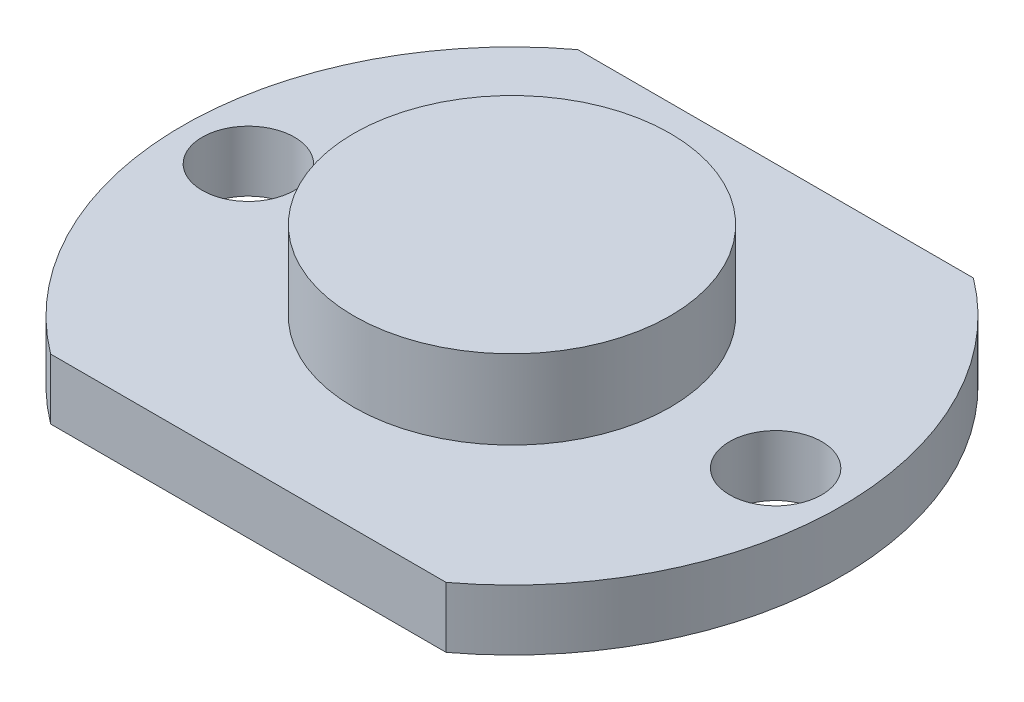
ISO-10303-21;
HEADER;
FILE_DESCRIPTION(('STEP AP214'),'2;1');
FILE_NAME('part.step','',(''),(''),'','','');
FILE_SCHEMA(('AUTOMOTIVE_DESIGN { 1 0 10303 214 1 1 1 1 }'));
ENDSEC;
DATA;
#1=APPLICATION_CONTEXT('core data for automotive mechanical design processes');
#2=APPLICATION_PROTOCOL_DEFINITION('international standard','automotive_design',2000,#1);
#3=PRODUCT_CONTEXT('',#1,'mechanical');
#4=PRODUCT('Part','Part','',(#3));
#5=PRODUCT_RELATED_PRODUCT_CATEGORY('part','',(#4));
#6=PRODUCT_DEFINITION_FORMATION('','',#4);
#7=PRODUCT_DEFINITION_CONTEXT('part definition',#1,'design');
#8=PRODUCT_DEFINITION('design','',#6,#7);
#9=PRODUCT_DEFINITION_SHAPE('','',#8);
#10=(LENGTH_UNIT() NAMED_UNIT(*) SI_UNIT(.MILLI.,.METRE.));
#11=(NAMED_UNIT(*) PLANE_ANGLE_UNIT() SI_UNIT($,.RADIAN.));
#12=(NAMED_UNIT(*) SI_UNIT($,.STERADIAN.) SOLID_ANGLE_UNIT());
#13=UNCERTAINTY_MEASURE_WITH_UNIT(LENGTH_MEASURE(1.E-05),#10,'distance_accuracy_value','');
#14=(GEOMETRIC_REPRESENTATION_CONTEXT(3) GLOBAL_UNCERTAINTY_ASSIGNED_CONTEXT((#13)) GLOBAL_UNIT_ASSIGNED_CONTEXT((#10,
#11,#12)) REPRESENTATION_CONTEXT('',''));
#15=CARTESIAN_POINT('',(0.,0.,0.));
#16=DIRECTION('',(0.,0.,1.));
#17=DIRECTION('',(1.,0.,0.));
#18=AXIS2_PLACEMENT_3D('',#15,#16,#17);
#19=CARTESIAN_POINT('',(0.,2.3,0.));
#20=DIRECTION('',(0.,1.,0.));
#21=DIRECTION('',(0.,0.,1.));
#22=AXIS2_PLACEMENT_3D('',#19,#20,#21);
#23=PLANE('',#22);
#24=CARTESIAN_POINT('',(-10.,2.3,0.));
#25=DIRECTION('',(0.,1.,0.));
#26=DIRECTION('',(0.,0.,1.));
#27=AXIS2_PLACEMENT_3D('',#24,#25,#26);
#28=CIRCLE('',#27,1.75);
#29=CARTESIAN_POINT('',(-10.,2.3,1.75));
#30=VERTEX_POINT('',#29);
#31=EDGE_CURVE('E115',#30,#30,#28,.T.);
#32=ORIENTED_EDGE('',*,*,#31,.F.);
#33=EDGE_LOOP('',(#32));
#34=FACE_BOUND('',#33,.T.);
#35=CARTESIAN_POINT('',(0.,2.3,0.));
#36=DIRECTION('',(0.,1.,0.));
#37=DIRECTION('',(0.,0.,1.));
#38=AXIS2_PLACEMENT_3D('',#35,#36,#37);
#39=CIRCLE('',#38,12.5);
#40=CARTESIAN_POINT('',(7.5,2.3,10.));
#41=VERTEX_POINT('',#40);
#42=CARTESIAN_POINT('',(7.5,2.3,-10.));
#43=VERTEX_POINT('',#42);
#44=EDGE_CURVE('E85',#41,#43,#39,.T.);
#45=ORIENTED_EDGE('',*,*,#44,.T.);
#46=DIRECTION('',(-1.,0.,0.));
#47=VECTOR('',#46,1.);
#48=CARTESIAN_POINT('',(7.5,2.3,-10.));
#49=LINE('',#48,#47);
#50=CARTESIAN_POINT('',(-7.5,2.3,-10.));
#51=VERTEX_POINT('',#50);
#52=EDGE_CURVE('E80',#43,#51,#49,.T.);
#53=ORIENTED_EDGE('',*,*,#52,.T.);
#54=CARTESIAN_POINT('',(0.,2.3,0.));
#55=DIRECTION('',(0.,1.,0.));
#56=DIRECTION('',(0.,0.,1.));
#57=AXIS2_PLACEMENT_3D('',#54,#55,#56);
#58=CIRCLE('',#57,12.5);
#59=CARTESIAN_POINT('',(-7.5,2.3,10.));
#60=VERTEX_POINT('',#59);
#61=EDGE_CURVE('E83',#51,#60,#58,.T.);
#62=ORIENTED_EDGE('',*,*,#61,.T.);
#63=DIRECTION('',(1.,0.,0.));
#64=VECTOR('',#63,1.);
#65=CARTESIAN_POINT('',(7.5,2.3,10.));
#66=LINE('',#65,#64);
#67=EDGE_CURVE('E50',#60,#41,#66,.T.);
#68=ORIENTED_EDGE('',*,*,#67,.T.);
#69=EDGE_LOOP('',(#45,#53,#62,#68));
#70=FACE_BOUND('',#69,.T.);
#71=CARTESIAN_POINT('',(10.,2.3,0.));
#72=DIRECTION('',(0.,1.,0.));
#73=DIRECTION('',(0.,0.,1.));
#74=AXIS2_PLACEMENT_3D('',#71,#72,#73);
#75=CIRCLE('',#74,1.75);
#76=CARTESIAN_POINT('',(10.,2.3,1.75));
#77=VERTEX_POINT('',#76);
#78=EDGE_CURVE('E100',#77,#77,#75,.T.);
#79=ORIENTED_EDGE('',*,*,#78,.F.);
#80=EDGE_LOOP('',(#79));
#81=FACE_BOUND('',#80,.T.);
#82=CARTESIAN_POINT('',(0.,2.3,0.));
#83=DIRECTION('',(0.,1.,0.));
#84=DIRECTION('',(0.,0.,1.));
#85=AXIS2_PLACEMENT_3D('',#82,#83,#84);
#86=CIRCLE('',#85,6.);
#87=CARTESIAN_POINT('',(0.,2.3,6.));
#88=VERTEX_POINT('',#87);
#89=EDGE_CURVE('E124',#88,#88,#86,.T.);
#90=ORIENTED_EDGE('',*,*,#89,.F.);
#91=EDGE_LOOP('',(#90));
#92=FACE_BOUND('',#91,.T.);
#93=ADVANCED_FACE('F33',(#34,#70,#81,#92),#23,.T.);
#94=CARTESIAN_POINT('',(0.,0.,0.));
#95=DIRECTION('',(0.,1.,0.));
#96=DIRECTION('',(0.,0.,1.));
#97=AXIS2_PLACEMENT_3D('',#94,#95,#96);
#98=PLANE('',#97);
#99=CARTESIAN_POINT('',(10.,0.,0.));
#100=DIRECTION('',(0.,1.,0.));
#101=DIRECTION('',(0.,0.,1.));
#102=AXIS2_PLACEMENT_3D('',#99,#100,#101);
#103=CIRCLE('',#102,1.75);
#104=CARTESIAN_POINT('',(10.,0.,1.75));
#105=VERTEX_POINT('',#104);
#106=EDGE_CURVE('E112',#105,#105,#103,.T.);
#107=ORIENTED_EDGE('',*,*,#106,.T.);
#108=EDGE_LOOP('',(#107));
#109=FACE_BOUND('',#108,.T.);
#110=CARTESIAN_POINT('',(0.,0.,0.));
#111=DIRECTION('',(0.,1.,0.));
#112=DIRECTION('',(0.,0.,1.));
#113=AXIS2_PLACEMENT_3D('',#110,#111,#112);
#114=CIRCLE('',#113,12.5);
#115=CARTESIAN_POINT('',(7.5,0.,10.));
#116=VERTEX_POINT('',#115);
#117=CARTESIAN_POINT('',(7.5,0.,-10.));
#118=VERTEX_POINT('',#117);
#119=EDGE_CURVE('E97',#116,#118,#114,.T.);
#120=ORIENTED_EDGE('',*,*,#119,.F.);
#121=DIRECTION('',(1.,0.,0.));
#122=VECTOR('',#121,1.);
#123=CARTESIAN_POINT('',(7.5,0.,10.));
#124=LINE('',#123,#122);
#125=CARTESIAN_POINT('',(-7.5,0.,10.));
#126=VERTEX_POINT('',#125);
#127=EDGE_CURVE('E73',#126,#116,#124,.T.);
#128=ORIENTED_EDGE('',*,*,#127,.F.);
#129=CARTESIAN_POINT('',(0.,0.,0.));
#130=DIRECTION('',(0.,1.,0.));
#131=DIRECTION('',(0.,0.,1.));
#132=AXIS2_PLACEMENT_3D('',#129,#130,#131);
#133=CIRCLE('',#132,12.5);
#134=CARTESIAN_POINT('',(-7.5,0.,-10.));
#135=VERTEX_POINT('',#134);
#136=EDGE_CURVE('E67',#135,#126,#133,.T.);
#137=ORIENTED_EDGE('',*,*,#136,.F.);
#138=DIRECTION('',(-1.,0.,0.));
#139=VECTOR('',#138,1.);
#140=CARTESIAN_POINT('',(7.5,0.,-10.));
#141=LINE('',#140,#139);
#142=EDGE_CURVE('E89',#118,#135,#141,.T.);
#143=ORIENTED_EDGE('',*,*,#142,.F.);
#144=EDGE_LOOP('',(#120,#128,#137,#143));
#145=FACE_BOUND('',#144,.T.);
#146=CARTESIAN_POINT('',(-10.,0.,0.));
#147=DIRECTION('',(0.,1.,0.));
#148=DIRECTION('',(0.,0.,1.));
#149=AXIS2_PLACEMENT_3D('',#146,#147,#148);
#150=CIRCLE('',#149,1.75);
#151=CARTESIAN_POINT('',(-10.,0.,1.75));
#152=VERTEX_POINT('',#151);
#153=EDGE_CURVE('E118',#152,#152,#150,.T.);
#154=ORIENTED_EDGE('',*,*,#153,.T.);
#155=EDGE_LOOP('',(#154));
#156=FACE_BOUND('',#155,.T.);
#157=ADVANCED_FACE('F108',(#109,#145,#156),#98,.F.);
#158=CARTESIAN_POINT('',(0.,2.3,0.));
#159=DIRECTION('',(0.,-1.,0.));
#160=DIRECTION('',(0.,0.,-1.));
#161=AXIS2_PLACEMENT_3D('',#158,#159,#160);
#162=CYLINDRICAL_SURFACE('',#161,12.5);
#163=ORIENTED_EDGE('',*,*,#119,.T.);
#164=DIRECTION('',(0.,-1.,0.));
#165=VECTOR('',#164,1.);
#166=CARTESIAN_POINT('',(7.5,2.3,-10.));
#167=LINE('',#166,#165);
#168=EDGE_CURVE('E11',#43,#118,#167,.T.);
#169=ORIENTED_EDGE('',*,*,#168,.F.);
#170=ORIENTED_EDGE('',*,*,#44,.F.);
#171=DIRECTION('',(0.,-1.,0.));
#172=VECTOR('',#171,1.);
#173=CARTESIAN_POINT('',(7.5,2.3,10.));
#174=LINE('',#173,#172);
#175=EDGE_CURVE('E93',#41,#116,#174,.T.);
#176=ORIENTED_EDGE('',*,*,#175,.T.);
#177=EDGE_LOOP('',(#163,#169,#170,#176));
#178=FACE_BOUND('',#177,.T.);
#179=ADVANCED_FACE('F35',(#178),#162,.T.);
#180=CARTESIAN_POINT('',(7.5,2.3,-10.));
#181=DIRECTION('',(0.,0.,1.));
#182=DIRECTION('',(1.,0.,0.));
#183=AXIS2_PLACEMENT_3D('',#180,#181,#182);
#184=PLANE('',#183);
#185=ORIENTED_EDGE('',*,*,#142,.T.);
#186=DIRECTION('',(0.,-1.,0.));
#187=VECTOR('',#186,1.);
#188=CARTESIAN_POINT('',(-7.5,2.3,-10.));
#189=LINE('',#188,#187);
#190=EDGE_CURVE('E42',#51,#135,#189,.T.);
#191=ORIENTED_EDGE('',*,*,#190,.F.);
#192=ORIENTED_EDGE('',*,*,#52,.F.);
#193=ORIENTED_EDGE('',*,*,#168,.T.);
#194=EDGE_LOOP('',(#185,#191,#192,#193));
#195=FACE_BOUND('',#194,.T.);
#196=ADVANCED_FACE('F88',(#195),#184,.F.);
#197=CARTESIAN_POINT('',(0.,2.3,0.));
#198=DIRECTION('',(0.,-1.,0.));
#199=DIRECTION('',(0.,0.,-1.));
#200=AXIS2_PLACEMENT_3D('',#197,#198,#199);
#201=CYLINDRICAL_SURFACE('',#200,12.5);
#202=ORIENTED_EDGE('',*,*,#136,.T.);
#203=DIRECTION('',(0.,-1.,0.));
#204=VECTOR('',#203,1.);
#205=CARTESIAN_POINT('',(-7.5,2.3,10.));
#206=LINE('',#205,#204);
#207=EDGE_CURVE('E90',#60,#126,#206,.T.);
#208=ORIENTED_EDGE('',*,*,#207,.F.);
#209=ORIENTED_EDGE('',*,*,#61,.F.);
#210=ORIENTED_EDGE('',*,*,#190,.T.);
#211=EDGE_LOOP('',(#202,#208,#209,#210));
#212=FACE_BOUND('',#211,.T.);
#213=ADVANCED_FACE('F91',(#212),#201,.T.);
#214=CARTESIAN_POINT('',(7.5,2.3,10.));
#215=DIRECTION('',(0.,0.,-1.));
#216=DIRECTION('',(-1.,0.,0.));
#217=AXIS2_PLACEMENT_3D('',#214,#215,#216);
#218=PLANE('',#217);
#219=ORIENTED_EDGE('',*,*,#127,.T.);
#220=ORIENTED_EDGE('',*,*,#175,.F.);
#221=ORIENTED_EDGE('',*,*,#67,.F.);
#222=ORIENTED_EDGE('',*,*,#207,.T.);
#223=EDGE_LOOP('',(#219,#220,#221,#222));
#224=FACE_BOUND('',#223,.T.);
#225=ADVANCED_FACE('F105',(#224),#218,.F.);
#226=CARTESIAN_POINT('',(10.,2.3,0.));
#227=DIRECTION('',(0.,-1.,0.));
#228=DIRECTION('',(0.,0.,-1.));
#229=AXIS2_PLACEMENT_3D('',#226,#227,#228);
#230=CYLINDRICAL_SURFACE('',#229,1.75);
#231=ORIENTED_EDGE('',*,*,#78,.T.);
#232=EDGE_LOOP('',(#231));
#233=FACE_BOUND('',#232,.T.);
#234=ORIENTED_EDGE('',*,*,#106,.F.);
#235=EDGE_LOOP('',(#234));
#236=FACE_BOUND('',#235,.T.);
#237=ADVANCED_FACE('F149',(#233,#236),#230,.F.);
#238=CARTESIAN_POINT('',(-10.,2.3,0.));
#239=DIRECTION('',(0.,-1.,0.));
#240=DIRECTION('',(0.,0.,-1.));
#241=AXIS2_PLACEMENT_3D('',#238,#239,#240);
#242=CYLINDRICAL_SURFACE('',#241,1.75);
#243=ORIENTED_EDGE('',*,*,#31,.T.);
#244=EDGE_LOOP('',(#243));
#245=FACE_BOUND('',#244,.T.);
#246=ORIENTED_EDGE('',*,*,#153,.F.);
#247=EDGE_LOOP('',(#246));
#248=FACE_BOUND('',#247,.T.);
#249=ADVANCED_FACE('F135',(#245,#248),#242,.F.);
#250=CARTESIAN_POINT('',(0.,5.3,0.));
#251=DIRECTION('',(0.,-1.,0.));
#252=DIRECTION('',(0.,0.,-1.));
#253=AXIS2_PLACEMENT_3D('',#250,#251,#252);
#254=CYLINDRICAL_SURFACE('',#253,6.);
#255=CARTESIAN_POINT('',(0.,5.3,0.));
#256=DIRECTION('',(0.,1.,0.));
#257=DIRECTION('',(0.,0.,1.));
#258=AXIS2_PLACEMENT_3D('',#255,#256,#257);
#259=CIRCLE('',#258,6.);
#260=CARTESIAN_POINT('',(0.,5.3,6.));
#261=VERTEX_POINT('',#260);
#262=EDGE_CURVE('E121',#261,#261,#259,.T.);
#263=ORIENTED_EDGE('',*,*,#262,.F.);
#264=EDGE_LOOP('',(#263));
#265=FACE_BOUND('',#264,.T.);
#266=ORIENTED_EDGE('',*,*,#89,.T.);
#267=EDGE_LOOP('',(#266));
#268=FACE_BOUND('',#267,.T.);
#269=ADVANCED_FACE('F132',(#265,#268),#254,.T.);
#270=CARTESIAN_POINT('',(0.,5.3,0.));
#271=DIRECTION('',(0.,1.,0.));
#272=DIRECTION('',(0.,0.,1.));
#273=AXIS2_PLACEMENT_3D('',#270,#271,#272);
#274=PLANE('',#273);
#275=ORIENTED_EDGE('',*,*,#262,.T.);
#276=EDGE_LOOP('',(#275));
#277=FACE_BOUND('',#276,.T.);
#278=ADVANCED_FACE('F130',(#277),#274,.T.);
#279=CLOSED_SHELL('',(#93,#157,#179,#196,#213,#225,#237,#249,#269,#278));
#280=MANIFOLD_SOLID_BREP('B2',#279);
#281=ADVANCED_BREP_SHAPE_REPRESENTATION('',(#18,#280),#14);
#282=SHAPE_DEFINITION_REPRESENTATION(#9,#281);
ENDSEC;
END-ISO-10303-21;
